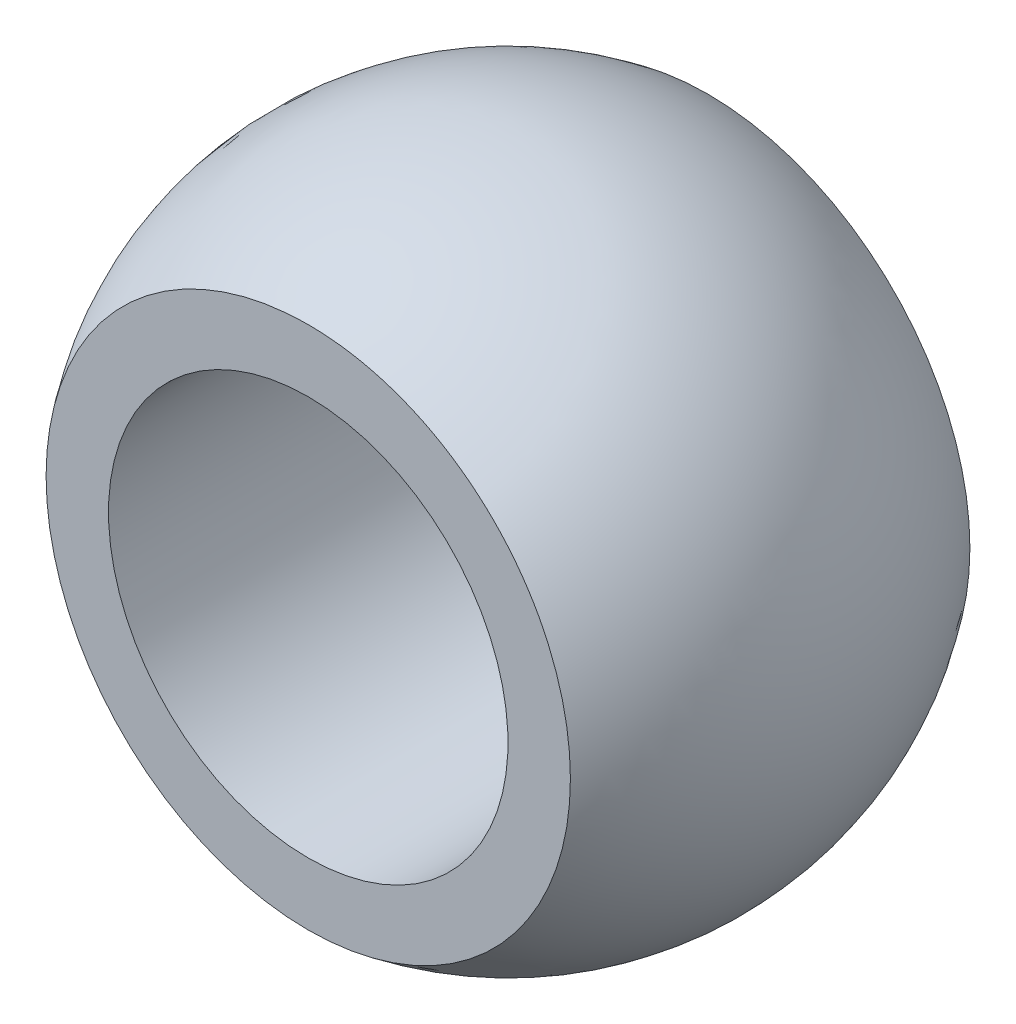
ISO-10303-21;
HEADER;
FILE_DESCRIPTION(('STEP AP214'),'2;1');
FILE_NAME('part.step','',(''),(''),'','','');
FILE_SCHEMA(('AUTOMOTIVE_DESIGN { 1 0 10303 214 1 1 1 1 }'));
ENDSEC;
DATA;
#1=APPLICATION_CONTEXT('core data for automotive mechanical design processes');
#2=APPLICATION_PROTOCOL_DEFINITION('international standard','automotive_design',2000,#1);
#3=PRODUCT_CONTEXT('',#1,'mechanical');
#4=PRODUCT('Part','Part','',(#3));
#5=PRODUCT_RELATED_PRODUCT_CATEGORY('part','',(#4));
#6=PRODUCT_DEFINITION_FORMATION('','',#4);
#7=PRODUCT_DEFINITION_CONTEXT('part definition',#1,'design');
#8=PRODUCT_DEFINITION('design','',#6,#7);
#9=PRODUCT_DEFINITION_SHAPE('','',#8);
#10=(LENGTH_UNIT() NAMED_UNIT(*) SI_UNIT(.MILLI.,.METRE.));
#11=(NAMED_UNIT(*) PLANE_ANGLE_UNIT() SI_UNIT($,.RADIAN.));
#12=(NAMED_UNIT(*) SI_UNIT($,.STERADIAN.) SOLID_ANGLE_UNIT());
#13=UNCERTAINTY_MEASURE_WITH_UNIT(LENGTH_MEASURE(1.E-05),#10,'distance_accuracy_value','');
#14=(GEOMETRIC_REPRESENTATION_CONTEXT(3) GLOBAL_UNCERTAINTY_ASSIGNED_CONTEXT((#13)) GLOBAL_UNIT_ASSIGNED_CONTEXT((#10,
#11,#12)) REPRESENTATION_CONTEXT('',''));
#15=CARTESIAN_POINT('',(0.,0.,0.));
#16=DIRECTION('',(0.,0.,1.));
#17=DIRECTION('',(1.,0.,0.));
#18=AXIS2_PLACEMENT_3D('',#15,#16,#17);
#19=CARTESIAN_POINT('',(0.,0.,10.5));
#20=DIRECTION('',(0.,0.,1.));
#21=DIRECTION('',(1.,0.,0.));
#22=AXIS2_PLACEMENT_3D('',#19,#20,#21);
#23=PLANE('',#22);
#24=CARTESIAN_POINT('',(0.,0.,10.5));
#25=DIRECTION('',(0.,0.,1.));
#26=DIRECTION('',(0.,1.,0.));
#27=AXIS2_PLACEMENT_3D('',#24,#25,#26);
#28=CIRCLE('',#27,4.);
#29=CARTESIAN_POINT('',(0.,4.,10.5));
#30=VERTEX_POINT('',#29);
#31=EDGE_CURVE('E52',#30,#30,#28,.T.);
#32=ORIENTED_EDGE('',*,*,#31,.F.);
#33=EDGE_LOOP('',(#32));
#34=FACE_BOUND('',#33,.T.);
#35=CARTESIAN_POINT('',(0.,0.,10.5));
#36=DIRECTION('',(0.,0.,-1.));
#37=DIRECTION('',(0.,-1.,0.));
#38=AXIS2_PLACEMENT_3D('',#35,#36,#37);
#39=CIRCLE('',#38,5.24976189936267);
#40=CARTESIAN_POINT('',(0.,-5.24976189936267,10.5));
#41=VERTEX_POINT('',#40);
#42=EDGE_CURVE('E24',#41,#41,#39,.T.);
#43=ORIENTED_EDGE('',*,*,#42,.F.);
#44=EDGE_LOOP('',(#43));
#45=FACE_BOUND('',#44,.T.);
#46=ADVANCED_FACE('F15',(#34,#45),#23,.T.);
#47=CARTESIAN_POINT('',(0.,0.,2.5));
#48=DIRECTION('',(0.,0.,-1.));
#49=DIRECTION('',(-1.,0.,0.));
#50=AXIS2_PLACEMENT_3D('',#47,#48,#49);
#51=PLANE('',#50);
#52=CARTESIAN_POINT('',(0.,0.,2.5));
#53=DIRECTION('',(0.,0.,-1.));
#54=DIRECTION('',(0.,1.,0.));
#55=AXIS2_PLACEMENT_3D('',#52,#53,#54);
#56=CIRCLE('',#55,4.);
#57=CARTESIAN_POINT('',(0.,4.,2.5));
#58=VERTEX_POINT('',#57);
#59=EDGE_CURVE('E10',#58,#58,#56,.T.);
#60=ORIENTED_EDGE('',*,*,#59,.F.);
#61=EDGE_LOOP('',(#60));
#62=FACE_BOUND('',#61,.T.);
#63=CARTESIAN_POINT('',(0.,0.,2.5));
#64=DIRECTION('',(0.,0.,1.));
#65=DIRECTION('',(0.,1.,0.));
#66=AXIS2_PLACEMENT_3D('',#63,#64,#65);
#67=CIRCLE('',#66,5.24976189936267);
#68=CARTESIAN_POINT('',(0.,5.24976189936267,2.5));
#69=VERTEX_POINT('',#68);
#70=EDGE_CURVE('E56',#69,#69,#67,.T.);
#71=ORIENTED_EDGE('',*,*,#70,.F.);
#72=EDGE_LOOP('',(#71));
#73=FACE_BOUND('',#72,.T.);
#74=ADVANCED_FACE('F38',(#62,#73),#51,.T.);
#75=CARTESIAN_POINT('',(0.,0.,6.5));
#76=DIRECTION('',(0.,0.,1.));
#77=DIRECTION('',(1.,0.,0.));
#78=AXIS2_PLACEMENT_3D('',#75,#76,#77);
#79=CYLINDRICAL_SURFACE('',#78,4.);
#80=ORIENTED_EDGE('',*,*,#59,.T.);
#81=EDGE_LOOP('',(#80));
#82=FACE_BOUND('',#81,.T.);
#83=ORIENTED_EDGE('',*,*,#31,.T.);
#84=EDGE_LOOP('',(#83));
#85=FACE_BOUND('',#84,.T.);
#86=ADVANCED_FACE('F17',(#82,#85),#79,.F.);
#87=CARTESIAN_POINT('',(0.,0.,6.5));
#88=DIRECTION('',(0.475797375617777,0.814050134490044,0.333075420726264));
#89=DIRECTION('',(-0.858662590298694,0.511949239417531,-0.0246278761031051));
#90=AXIS2_PLACEMENT_3D('',#87,#88,#89);
#91=SPHERICAL_SURFACE('',#90,6.6);
#92=ORIENTED_EDGE('',*,*,#70,.T.);
#93=EDGE_LOOP('',(#92));
#94=FACE_BOUND('',#93,.T.);
#95=CARTESIAN_POINT('',(-3.14026267907733,-5.37273088763429,4.30170222320666));
#96=VERTEX_POINT('',#95);
#97=VERTEX_LOOP('',#96);
#98=FACE_BOUND('',#97,.T.);
#99=ORIENTED_EDGE('',*,*,#42,.T.);
#100=EDGE_LOOP('',(#99));
#101=FACE_BOUND('',#100,.T.);
#102=CARTESIAN_POINT('',(3.14026267907733,5.37273088763429,8.69829777679334));
#103=VERTEX_POINT('',#102);
#104=VERTEX_LOOP('',#103);
#105=FACE_BOUND('',#104,.T.);
#106=ADVANCED_FACE('F31',(#94,#98,#101,#105),#91,.T.);
#107=CLOSED_SHELL('',(#46,#74,#86,#106));
#108=MANIFOLD_SOLID_BREP('B1',#107);
#109=ADVANCED_BREP_SHAPE_REPRESENTATION('',(#18,#108),#14);
#110=SHAPE_DEFINITION_REPRESENTATION(#9,#109);
ENDSEC;
END-ISO-10303-21;
